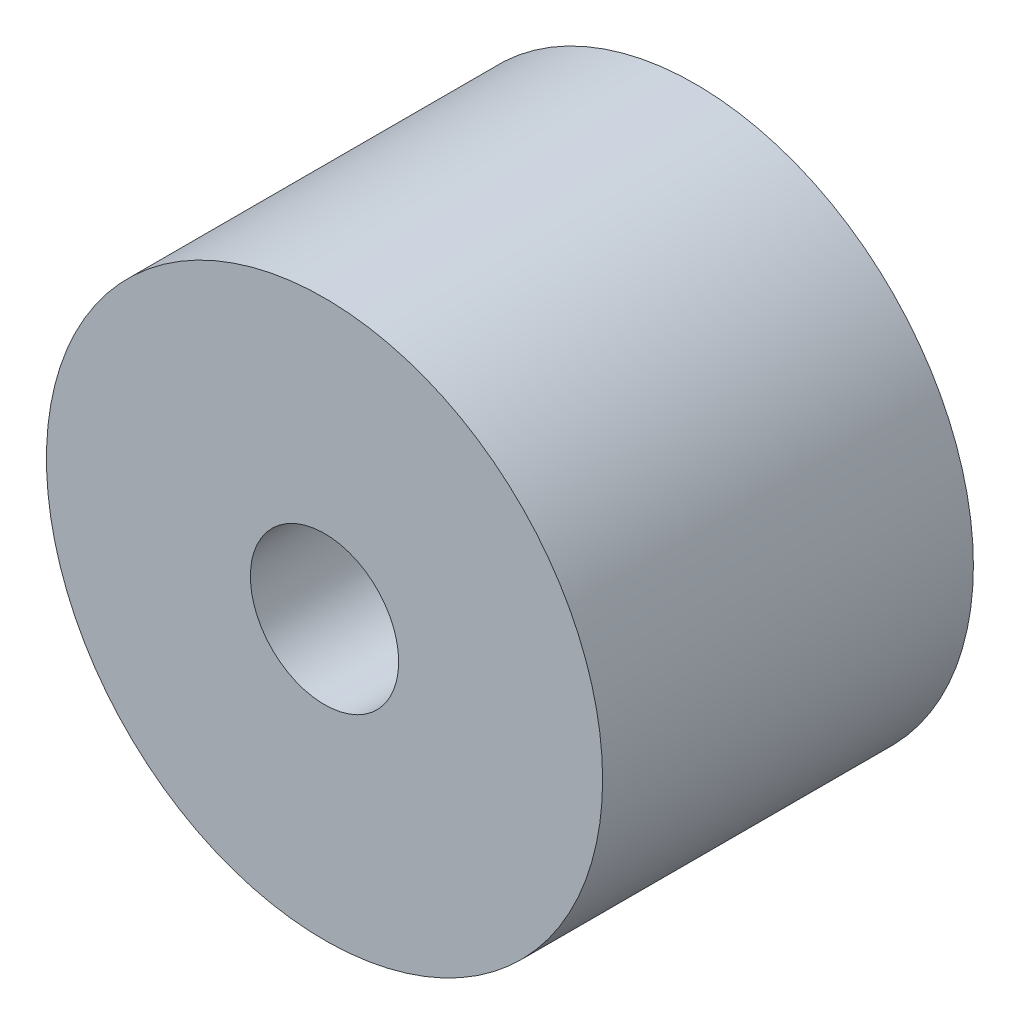
ISO-10303-21;
HEADER;
FILE_DESCRIPTION(('STEP AP214'),'2;1');
FILE_NAME('part.step','',(''),(''),'','','');
FILE_SCHEMA(('AUTOMOTIVE_DESIGN { 1 0 10303 214 1 1 1 1 }'));
ENDSEC;
DATA;
#1=APPLICATION_CONTEXT('core data for automotive mechanical design processes');
#2=APPLICATION_PROTOCOL_DEFINITION('international standard','automotive_design',2000,#1);
#3=PRODUCT_CONTEXT('',#1,'mechanical');
#4=PRODUCT('Part','Part','',(#3));
#5=PRODUCT_RELATED_PRODUCT_CATEGORY('part','',(#4));
#6=PRODUCT_DEFINITION_FORMATION('','',#4);
#7=PRODUCT_DEFINITION_CONTEXT('part definition',#1,'design');
#8=PRODUCT_DEFINITION('design','',#6,#7);
#9=PRODUCT_DEFINITION_SHAPE('','',#8);
#10=(LENGTH_UNIT() NAMED_UNIT(*) SI_UNIT(.MILLI.,.METRE.));
#11=(NAMED_UNIT(*) PLANE_ANGLE_UNIT() SI_UNIT($,.RADIAN.));
#12=(NAMED_UNIT(*) SI_UNIT($,.STERADIAN.) SOLID_ANGLE_UNIT());
#13=UNCERTAINTY_MEASURE_WITH_UNIT(LENGTH_MEASURE(1.E-05),#10,'distance_accuracy_value','');
#14=(GEOMETRIC_REPRESENTATION_CONTEXT(3) GLOBAL_UNCERTAINTY_ASSIGNED_CONTEXT((#13)) GLOBAL_UNIT_ASSIGNED_CONTEXT((#10,
#11,#12)) REPRESENTATION_CONTEXT('',''));
#15=CARTESIAN_POINT('',(0.,0.,0.));
#16=DIRECTION('',(0.,0.,1.));
#17=DIRECTION('',(1.,0.,0.));
#18=AXIS2_PLACEMENT_3D('',#15,#16,#17);
#19=CARTESIAN_POINT('',(0.,0.,10.));
#20=DIRECTION('',(0.,0.,1.));
#21=DIRECTION('',(1.,0.,0.));
#22=AXIS2_PLACEMENT_3D('',#19,#20,#21);
#23=PLANE('',#22);
#24=CARTESIAN_POINT('',(0.,0.,10.));
#25=DIRECTION('',(0.,0.,1.));
#26=DIRECTION('',(1.,0.,0.));
#27=AXIS2_PLACEMENT_3D('',#24,#25,#26);
#28=CIRCLE('',#27,15.);
#29=CARTESIAN_POINT('',(15.,0.,10.));
#30=VERTEX_POINT('',#29);
#31=EDGE_CURVE('E10',#30,#30,#28,.T.);
#32=ORIENTED_EDGE('',*,*,#31,.T.);
#33=EDGE_LOOP('',(#32));
#34=FACE_BOUND('',#33,.T.);
#35=CARTESIAN_POINT('',(0.,0.,10.));
#36=DIRECTION('',(0.,0.,1.));
#37=DIRECTION('',(1.,0.,0.));
#38=AXIS2_PLACEMENT_3D('',#35,#36,#37);
#39=CIRCLE('',#38,4.);
#40=CARTESIAN_POINT('',(4.,0.,10.));
#41=VERTEX_POINT('',#40);
#42=EDGE_CURVE('E50',#41,#41,#39,.T.);
#43=ORIENTED_EDGE('',*,*,#42,.F.);
#44=EDGE_LOOP('',(#43));
#45=FACE_BOUND('',#44,.T.);
#46=ADVANCED_FACE('F37',(#34,#45),#23,.T.);
#47=CARTESIAN_POINT('',(0.,0.,-10.));
#48=DIRECTION('',(0.,0.,1.));
#49=DIRECTION('',(1.,0.,0.));
#50=AXIS2_PLACEMENT_3D('',#47,#48,#49);
#51=PLANE('',#50);
#52=CARTESIAN_POINT('',(0.,0.,-10.));
#53=DIRECTION('',(0.,0.,1.));
#54=DIRECTION('',(1.,0.,0.));
#55=AXIS2_PLACEMENT_3D('',#52,#53,#54);
#56=CIRCLE('',#55,15.);
#57=CARTESIAN_POINT('',(15.,0.,-10.));
#58=VERTEX_POINT('',#57);
#59=EDGE_CURVE('E41',#58,#58,#56,.T.);
#60=ORIENTED_EDGE('',*,*,#59,.F.);
#61=EDGE_LOOP('',(#60));
#62=FACE_BOUND('',#61,.T.);
#63=CARTESIAN_POINT('',(0.,0.,-10.));
#64=DIRECTION('',(0.,0.,1.));
#65=DIRECTION('',(1.,0.,0.));
#66=AXIS2_PLACEMENT_3D('',#63,#64,#65);
#67=CIRCLE('',#66,4.);
#68=CARTESIAN_POINT('',(4.,0.,-10.));
#69=VERTEX_POINT('',#68);
#70=EDGE_CURVE('E52',#69,#69,#67,.T.);
#71=ORIENTED_EDGE('',*,*,#70,.T.);
#72=EDGE_LOOP('',(#71));
#73=FACE_BOUND('',#72,.T.);
#74=ADVANCED_FACE('F64',(#62,#73),#51,.F.);
#75=CARTESIAN_POINT('',(0.,0.,10.));
#76=DIRECTION('',(0.,0.,-1.));
#77=DIRECTION('',(-1.,0.,0.));
#78=AXIS2_PLACEMENT_3D('',#75,#76,#77);
#79=CYLINDRICAL_SURFACE('',#78,15.);
#80=ORIENTED_EDGE('',*,*,#31,.F.);
#81=EDGE_LOOP('',(#80));
#82=FACE_BOUND('',#81,.T.);
#83=ORIENTED_EDGE('',*,*,#59,.T.);
#84=EDGE_LOOP('',(#83));
#85=FACE_BOUND('',#84,.T.);
#86=ADVANCED_FACE('F39',(#82,#85),#79,.T.);
#87=CARTESIAN_POINT('',(0.,0.,10.));
#88=DIRECTION('',(0.,0.,-1.));
#89=DIRECTION('',(-1.,0.,0.));
#90=AXIS2_PLACEMENT_3D('',#87,#88,#89);
#91=CYLINDRICAL_SURFACE('',#90,4.);
#92=ORIENTED_EDGE('',*,*,#42,.T.);
#93=EDGE_LOOP('',(#92));
#94=FACE_BOUND('',#93,.T.);
#95=ORIENTED_EDGE('',*,*,#70,.F.);
#96=EDGE_LOOP('',(#95));
#97=FACE_BOUND('',#96,.T.);
#98=ADVANCED_FACE('F60',(#94,#97),#91,.F.);
#99=CLOSED_SHELL('',(#46,#74,#86,#98));
#100=MANIFOLD_SOLID_BREP('B2',#99);
#101=ADVANCED_BREP_SHAPE_REPRESENTATION('',(#18,#100),#14);
#102=SHAPE_DEFINITION_REPRESENTATION(#9,#101);
ENDSEC;
END-ISO-10303-21;
